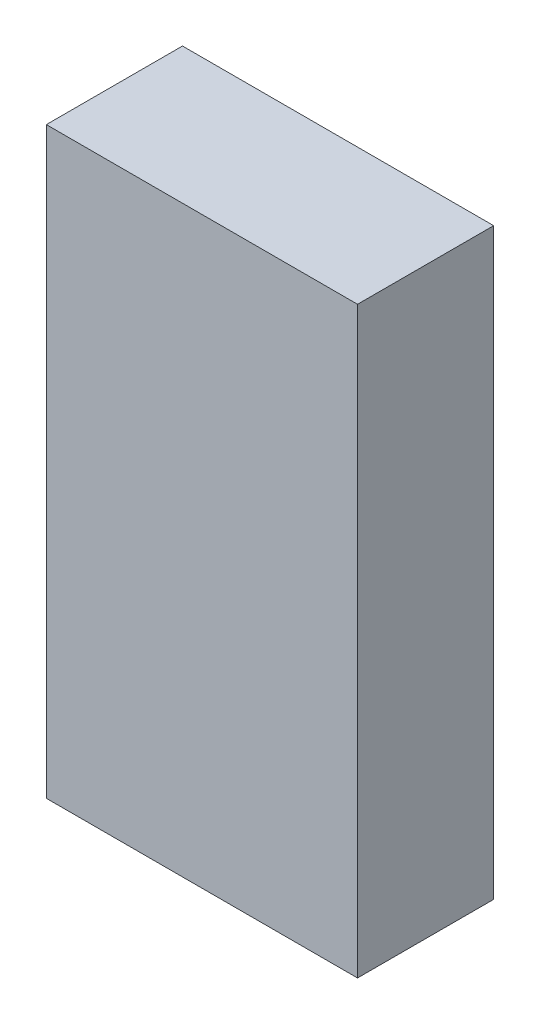
ISO-10303-21;
HEADER;
FILE_DESCRIPTION(('STEP AP214'),'2;1');
FILE_NAME('part.step','',(''),(''),'','','');
FILE_SCHEMA(('AUTOMOTIVE_DESIGN { 1 0 10303 214 1 1 1 1 }'));
ENDSEC;
DATA;
#1=APPLICATION_CONTEXT('core data for automotive mechanical design processes');
#2=APPLICATION_PROTOCOL_DEFINITION('international standard','automotive_design',2000,#1);
#3=PRODUCT_CONTEXT('',#1,'mechanical');
#4=PRODUCT('Part','Part','',(#3));
#5=PRODUCT_RELATED_PRODUCT_CATEGORY('part','',(#4));
#6=PRODUCT_DEFINITION_FORMATION('','',#4);
#7=PRODUCT_DEFINITION_CONTEXT('part definition',#1,'design');
#8=PRODUCT_DEFINITION('design','',#6,#7);
#9=PRODUCT_DEFINITION_SHAPE('','',#8);
#10=(LENGTH_UNIT() NAMED_UNIT(*) SI_UNIT(.MILLI.,.METRE.));
#11=(NAMED_UNIT(*) PLANE_ANGLE_UNIT() SI_UNIT($,.RADIAN.));
#12=(NAMED_UNIT(*) SI_UNIT($,.STERADIAN.) SOLID_ANGLE_UNIT());
#13=UNCERTAINTY_MEASURE_WITH_UNIT(LENGTH_MEASURE(1.E-05),#10,'distance_accuracy_value','');
#14=(GEOMETRIC_REPRESENTATION_CONTEXT(3) GLOBAL_UNCERTAINTY_ASSIGNED_CONTEXT((#13)) GLOBAL_UNIT_ASSIGNED_CONTEXT((#10,
#11,#12)) REPRESENTATION_CONTEXT('',''));
#15=CARTESIAN_POINT('',(0.,0.,0.));
#16=DIRECTION('',(0.,0.,1.));
#17=DIRECTION('',(1.,0.,0.));
#18=AXIS2_PLACEMENT_3D('',#15,#16,#17);
#19=CARTESIAN_POINT('',(-8.,0.,-7.));
#20=DIRECTION('',(-1.,0.,0.));
#21=DIRECTION('',(0.,0.,1.));
#22=AXIS2_PLACEMENT_3D('',#19,#20,#21);
#23=PLANE('',#22);
#24=DIRECTION('',(0.,-1.,0.));
#25=VECTOR('',#24,1.);
#26=CARTESIAN_POINT('',(-8.,0.,0.));
#27=LINE('',#26,#25);
#28=CARTESIAN_POINT('',(-8.,30.,0.));
#29=VERTEX_POINT('',#28);
#30=CARTESIAN_POINT('',(-8.,0.,0.));
#31=VERTEX_POINT('',#30);
#32=EDGE_CURVE('E94',#29,#31,#27,.T.);
#33=ORIENTED_EDGE('',*,*,#32,.F.);
#34=DIRECTION('',(0.,0.,1.));
#35=VECTOR('',#34,1.);
#36=CARTESIAN_POINT('',(-8.,30.,-7.));
#37=LINE('',#36,#35);
#38=CARTESIAN_POINT('',(-8.,30.,-7.));
#39=VERTEX_POINT('',#38);
#40=EDGE_CURVE('E43',#39,#29,#37,.T.);
#41=ORIENTED_EDGE('',*,*,#40,.F.);
#42=DIRECTION('',(0.,-1.,0.));
#43=VECTOR('',#42,1.);
#44=CARTESIAN_POINT('',(-8.,0.,-7.));
#45=LINE('',#44,#43);
#46=CARTESIAN_POINT('',(-8.,0.,-7.));
#47=VERTEX_POINT('',#46);
#48=EDGE_CURVE('E90',#39,#47,#45,.T.);
#49=ORIENTED_EDGE('',*,*,#48,.T.);
#50=DIRECTION('',(0.,0.,1.));
#51=VECTOR('',#50,1.);
#52=CARTESIAN_POINT('',(-8.,0.,-7.));
#53=LINE('',#52,#51);
#54=EDGE_CURVE('E11',#47,#31,#53,.T.);
#55=ORIENTED_EDGE('',*,*,#54,.T.);
#56=EDGE_LOOP('',(#33,#41,#49,#55));
#57=FACE_BOUND('',#56,.T.);
#58=ADVANCED_FACE('F33',(#57),#23,.T.);
#59=CARTESIAN_POINT('',(-1.5,30.,-7.));
#60=DIRECTION('',(0.,1.,0.));
#61=DIRECTION('',(0.,0.,1.));
#62=AXIS2_PLACEMENT_3D('',#59,#60,#61);
#63=PLANE('',#62);
#64=DIRECTION('',(-1.,0.,0.));
#65=VECTOR('',#64,1.);
#66=CARTESIAN_POINT('',(-1.5,30.,0.));
#67=LINE('',#66,#65);
#68=CARTESIAN_POINT('',(8.,30.,0.));
#69=VERTEX_POINT('',#68);
#70=EDGE_CURVE('E79',#69,#29,#67,.T.);
#71=ORIENTED_EDGE('',*,*,#70,.F.);
#72=DIRECTION('',(0.,0.,1.));
#73=VECTOR('',#72,1.);
#74=CARTESIAN_POINT('',(8.,30.,-7.));
#75=LINE('',#74,#73);
#76=CARTESIAN_POINT('',(8.,30.,-7.));
#77=VERTEX_POINT('',#76);
#78=EDGE_CURVE('E75',#77,#69,#75,.T.);
#79=ORIENTED_EDGE('',*,*,#78,.F.);
#80=DIRECTION('',(-1.,0.,0.));
#81=VECTOR('',#80,1.);
#82=CARTESIAN_POINT('',(-1.5,30.,-7.));
#83=LINE('',#82,#81);
#84=EDGE_CURVE('E78',#77,#39,#83,.T.);
#85=ORIENTED_EDGE('',*,*,#84,.T.);
#86=ORIENTED_EDGE('',*,*,#40,.T.);
#87=EDGE_LOOP('',(#71,#79,#85,#86));
#88=FACE_BOUND('',#87,.T.);
#89=ADVANCED_FACE('F77',(#88),#63,.T.);
#90=CARTESIAN_POINT('',(8.,0.,-7.));
#91=DIRECTION('',(1.,0.,0.));
#92=DIRECTION('',(0.,0.,-1.));
#93=AXIS2_PLACEMENT_3D('',#90,#91,#92);
#94=PLANE('',#93);
#95=DIRECTION('',(0.,1.,0.));
#96=VECTOR('',#95,1.);
#97=CARTESIAN_POINT('',(8.,0.,0.));
#98=LINE('',#97,#96);
#99=CARTESIAN_POINT('',(8.,0.,0.));
#100=VERTEX_POINT('',#99);
#101=EDGE_CURVE('E99',#100,#69,#98,.T.);
#102=ORIENTED_EDGE('',*,*,#101,.F.);
#103=DIRECTION('',(0.,0.,1.));
#104=VECTOR('',#103,1.);
#105=CARTESIAN_POINT('',(8.,0.,-7.));
#106=LINE('',#105,#104);
#107=CARTESIAN_POINT('',(8.,0.,-7.));
#108=VERTEX_POINT('',#107);
#109=EDGE_CURVE('E37',#108,#100,#106,.T.);
#110=ORIENTED_EDGE('',*,*,#109,.F.);
#111=DIRECTION('',(0.,1.,0.));
#112=VECTOR('',#111,1.);
#113=CARTESIAN_POINT('',(8.,0.,-7.));
#114=LINE('',#113,#112);
#115=EDGE_CURVE('E88',#108,#77,#114,.T.);
#116=ORIENTED_EDGE('',*,*,#115,.T.);
#117=ORIENTED_EDGE('',*,*,#78,.T.);
#118=EDGE_LOOP('',(#102,#110,#116,#117));
#119=FACE_BOUND('',#118,.T.);
#120=ADVANCED_FACE('F92',(#119),#94,.T.);
#121=CARTESIAN_POINT('',(0.,0.,-7.));
#122=DIRECTION('',(0.,-1.,0.));
#123=DIRECTION('',(0.,0.,-1.));
#124=AXIS2_PLACEMENT_3D('',#121,#122,#123);
#125=PLANE('',#124);
#126=DIRECTION('',(1.,0.,0.));
#127=VECTOR('',#126,1.);
#128=CARTESIAN_POINT('',(0.,0.,0.));
#129=LINE('',#128,#127);
#130=EDGE_CURVE('E69',#31,#100,#129,.T.);
#131=ORIENTED_EDGE('',*,*,#130,.F.);
#132=ORIENTED_EDGE('',*,*,#54,.F.);
#133=DIRECTION('',(1.,0.,0.));
#134=VECTOR('',#133,1.);
#135=CARTESIAN_POINT('',(0.,0.,-7.));
#136=LINE('',#135,#134);
#137=EDGE_CURVE('E71',#47,#108,#136,.T.);
#138=ORIENTED_EDGE('',*,*,#137,.T.);
#139=ORIENTED_EDGE('',*,*,#109,.T.);
#140=EDGE_LOOP('',(#131,#132,#138,#139));
#141=FACE_BOUND('',#140,.T.);
#142=ADVANCED_FACE('F35',(#141),#125,.T.);
#143=CARTESIAN_POINT('',(0.,0.,-7.));
#144=DIRECTION('',(0.,0.,-1.));
#145=DIRECTION('',(-1.,0.,0.));
#146=AXIS2_PLACEMENT_3D('',#143,#144,#145);
#147=PLANE('',#146);
#148=ORIENTED_EDGE('',*,*,#137,.F.);
#149=ORIENTED_EDGE('',*,*,#48,.F.);
#150=ORIENTED_EDGE('',*,*,#84,.F.);
#151=ORIENTED_EDGE('',*,*,#115,.F.);
#152=EDGE_LOOP('',(#148,#149,#150,#151));
#153=FACE_BOUND('',#152,.T.);
#154=ADVANCED_FACE('F87',(#153),#147,.T.);
#155=CARTESIAN_POINT('',(0.,0.,0.));
#156=DIRECTION('',(0.,0.,-1.));
#157=DIRECTION('',(-1.,0.,0.));
#158=AXIS2_PLACEMENT_3D('',#155,#156,#157);
#159=PLANE('',#158);
#160=ORIENTED_EDGE('',*,*,#32,.T.);
#161=ORIENTED_EDGE('',*,*,#130,.T.);
#162=ORIENTED_EDGE('',*,*,#101,.T.);
#163=ORIENTED_EDGE('',*,*,#70,.T.);
#164=EDGE_LOOP('',(#160,#161,#162,#163));
#165=FACE_BOUND('',#164,.T.);
#166=ADVANCED_FACE('F106',(#165),#159,.F.);
#167=CLOSED_SHELL('',(#58,#89,#120,#142,#154,#166));
#168=MANIFOLD_SOLID_BREP('B2',#167);
#169=ADVANCED_BREP_SHAPE_REPRESENTATION('',(#18,#168),#14);
#170=SHAPE_DEFINITION_REPRESENTATION(#9,#169);
ENDSEC;
END-ISO-10303-21;
